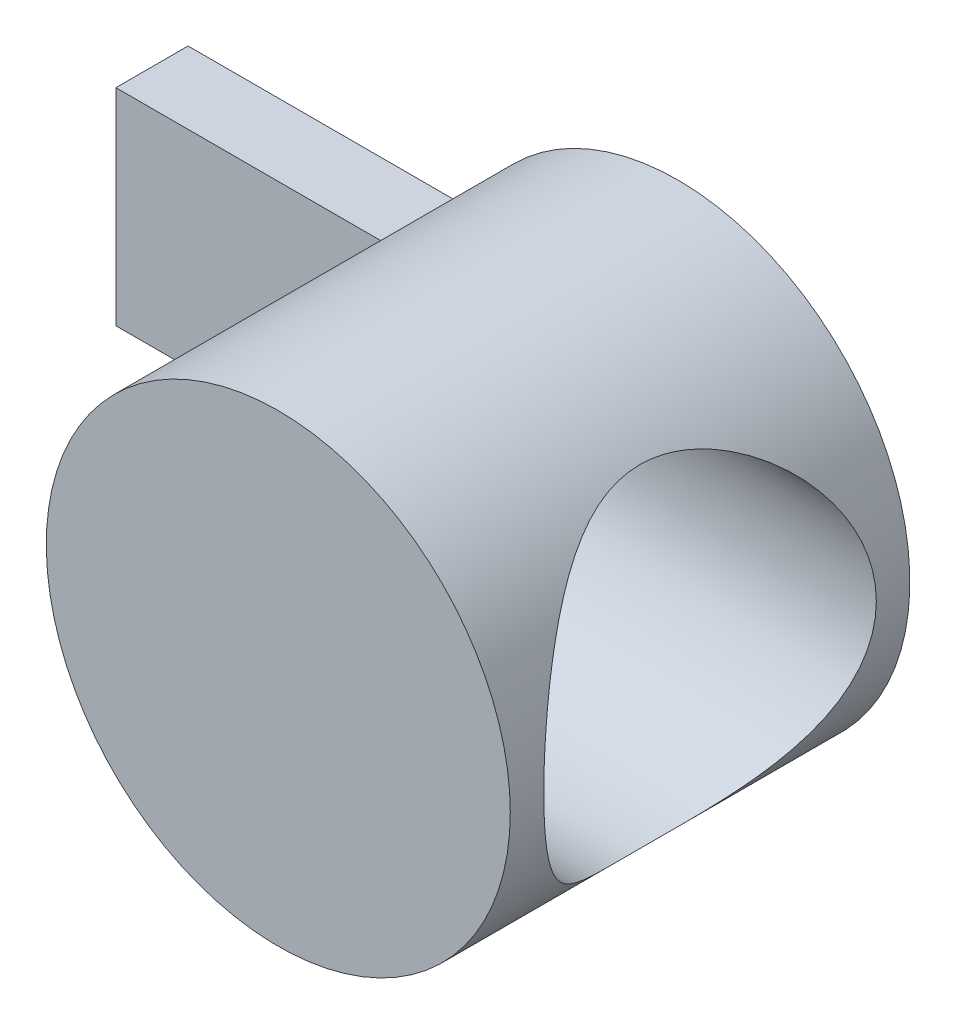
ISO-10303-21;
HEADER;
FILE_DESCRIPTION(('STEP AP214'),'2;1');
FILE_NAME('part.step','',(''),(''),'','','');
FILE_SCHEMA(('AUTOMOTIVE_DESIGN { 1 0 10303 214 1 1 1 1 }'));
ENDSEC;
DATA;
#1=APPLICATION_CONTEXT('core data for automotive mechanical design processes');
#2=APPLICATION_PROTOCOL_DEFINITION('international standard','automotive_design',2000,#1);
#3=PRODUCT_CONTEXT('',#1,'mechanical');
#4=PRODUCT('Part','Part','',(#3));
#5=PRODUCT_RELATED_PRODUCT_CATEGORY('part','',(#4));
#6=PRODUCT_DEFINITION_FORMATION('','',#4);
#7=PRODUCT_DEFINITION_CONTEXT('part definition',#1,'design');
#8=PRODUCT_DEFINITION('design','',#6,#7);
#9=PRODUCT_DEFINITION_SHAPE('','',#8);
#10=(LENGTH_UNIT() NAMED_UNIT(*) SI_UNIT(.MILLI.,.METRE.));
#11=(NAMED_UNIT(*) PLANE_ANGLE_UNIT() SI_UNIT($,.RADIAN.));
#12=(NAMED_UNIT(*) SI_UNIT($,.STERADIAN.) SOLID_ANGLE_UNIT());
#13=UNCERTAINTY_MEASURE_WITH_UNIT(LENGTH_MEASURE(1.E-05),#10,'distance_accuracy_value','');
#14=(GEOMETRIC_REPRESENTATION_CONTEXT(3) GLOBAL_UNCERTAINTY_ASSIGNED_CONTEXT((#13)) GLOBAL_UNIT_ASSIGNED_CONTEXT((#10,
#11,#12)) REPRESENTATION_CONTEXT('',''));
#15=CARTESIAN_POINT('',(0.,0.,0.));
#16=DIRECTION('',(0.,0.,1.));
#17=DIRECTION('',(1.,0.,0.));
#18=AXIS2_PLACEMENT_3D('',#15,#16,#17);
#19=CARTESIAN_POINT('',(0.,0.,15.5));
#20=DIRECTION('',(0.,0.,-1.));
#21=DIRECTION('',(-1.,0.,0.));
#22=AXIS2_PLACEMENT_3D('',#19,#20,#21);
#23=CYLINDRICAL_SURFACE('',#22,9.);
#24=CARTESIAN_POINT('',(-9.,0.,11.75));
#25=CARTESIAN_POINT('',(-8.99999931236003,-0.106543560764115,11.7499991633007));
#26=CARTESIAN_POINT('',(-8.99810295733528,-0.213114535933689,11.745737372374));
#27=CARTESIAN_POINT('',(-8.99056534028924,-0.42548775947288,11.7287335893494));
#28=CARTESIAN_POINT('',(-8.9849219391011,-0.531289533809613,11.7159867531779));
#29=CARTESIAN_POINT('',(-8.97002203225641,-0.741497571680321,11.6821151074332));
#30=CARTESIAN_POINT('',(-8.96075877099567,-0.845900846236376,11.6609746319474));
#31=CARTESIAN_POINT('',(-8.93886560682324,-1.0523739381887,11.6105472820358));
#32=CARTESIAN_POINT('',(-8.92623432770846,-1.15444278316294,11.5812570773423));
#33=CARTESIAN_POINT('',(-8.88385509084484,-1.45528706477071,11.481826836376));
#34=CARTESIAN_POINT('',(-8.84954694128079,-1.64969223818529,11.3999645338792));
#35=CARTESIAN_POINT('',(-8.77205693690159,-2.02169397175996,11.207842670196));
#36=CARTESIAN_POINT('',(-8.72887710525828,-2.19929435076136,11.0975895820297));
#37=CARTESIAN_POINT('',(-8.63520005099137,-2.54295194306068,10.845329590415));
#38=CARTESIAN_POINT('',(-8.58444255570291,-2.70796463469603,10.701994251306));
#39=CARTESIAN_POINT('',(-8.48237167141423,-3.01251193717389,10.3905139421417));
#40=CARTESIAN_POINT('',(-8.43105797021839,-3.15203136079603,10.2223542905208));
#41=CARTESIAN_POINT('',(-8.33031613694453,-3.40970641309573,9.85407902268029));
#42=CARTESIAN_POINT('',(-8.28116793674049,-3.52616342827005,9.65267892352655));
#43=CARTESIAN_POINT('',(-8.21620901778825,-3.67379855799914,9.33644164882016));
#44=CARTESIAN_POINT('',(-8.19601074422211,-3.71851343023117,9.22863042209207));
#45=CARTESIAN_POINT('',(-8.15924882688405,-3.79849956446532,9.00898088433418));
#46=CARTESIAN_POINT('',(-8.14268322901324,-3.83377590592702,8.89714477625805));
#47=CARTESIAN_POINT('',(-8.11458487568386,-3.89288163397949,8.6762099952243));
#48=CARTESIAN_POINT('',(-8.1028347628908,-3.91721191584564,8.56727257329993));
#49=CARTESIAN_POINT('',(-8.08362129694743,-3.95670961203999,8.34742166203978));
#50=CARTESIAN_POINT('',(-8.07615587883755,-3.9718814403629,8.23650915119343));
#51=CARTESIAN_POINT('',(-8.06579894008708,-3.99287182782271,8.01362775517661));
#52=CARTESIAN_POINT('',(-8.06290582244073,-3.99869365272533,7.90165925259327));
#53=CARTESIAN_POINT('',(-8.06180452405908,-4.00091360303008,7.67761087871269));
#54=CARTESIAN_POINT('',(-8.06359604232092,-3.99731233389618,7.5655310150333));
#55=CARTESIAN_POINT('',(-8.07142338434779,-3.98148137626882,7.35227281952782));
#56=CARTESIAN_POINT('',(-8.07706352800997,-3.97005575276389,7.25101953786572));
#57=CARTESIAN_POINT('',(-8.09197245318637,-3.9395760613895,7.04992893082565));
#58=CARTESIAN_POINT('',(-8.10124240729389,-3.92051952834525,6.9500920738277));
#59=CARTESIAN_POINT('',(-8.13408651281412,-3.85217674750056,6.65376237070128));
#60=CARTESIAN_POINT('',(-8.16270181226473,-3.79170447177769,6.46028212196665));
#61=CARTESIAN_POINT('',(-8.23081734439647,-3.64150006667489,6.08210151031394));
#62=CARTESIAN_POINT('',(-8.2705474900895,-3.5511416190136,5.89769571294764));
#63=CARTESIAN_POINT('',(-8.35638151227701,-3.34416344596326,5.54585657136231));
#64=CARTESIAN_POINT('',(-8.40248806916055,-3.22753266369898,5.3784304162798));
#65=CARTESIAN_POINT('',(-8.50133279495595,-2.95801583387873,5.04817022057705));
#66=CARTESIAN_POINT('',(-8.55427944513663,-2.80270476501177,4.88737235198051));
#67=CARTESIAN_POINT('',(-8.65709798777378,-2.46687651443058,4.59336580427856));
#68=CARTESIAN_POINT('',(-8.70696894746715,-2.28635173983005,4.46016546604656));
#69=CARTESIAN_POINT('',(-8.79984898075653,-1.89830549192186,4.22157335103708));
#70=CARTESIAN_POINT('',(-8.84261183911195,-1.69014406889665,4.11711926094858));
#71=CARTESIAN_POINT('',(-8.91451161297059,-1.25681485203023,3.94544615280709));
#72=CARTESIAN_POINT('',(-8.94365711683337,-1.03165788152718,3.87820366073887));
#73=CARTESIAN_POINT('',(-8.98336516942802,-0.587641070885757,3.78737621864508));
#74=CARTESIAN_POINT('',(-8.99508492412832,-0.369442331131814,3.76106658932887));
#75=CARTESIAN_POINT('',(-9.00240007523686,0.0685540826286679,3.74459377002601));
#76=CARTESIAN_POINT('',(-8.9980009485081,0.288351188214384,3.75441830240177));
#77=CARTESIAN_POINT('',(-8.97430591809511,0.70981481436903,3.80808709951779));
#78=CARTESIAN_POINT('',(-8.95589038121198,0.911792765731198,3.84992162133064));
#79=CARTESIAN_POINT('',(-8.90701082021956,1.30558421565956,3.96351612193435));
#80=CARTESIAN_POINT('',(-8.87654533185795,1.49739647572632,4.03527973762285));
#81=CARTESIAN_POINT('',(-8.80524764691282,1.87220783588442,4.20897713672047));
#82=CARTESIAN_POINT('',(-8.76412168349642,2.05474529218522,4.31178231674019));
#83=CARTESIAN_POINT('',(-8.67576208193101,2.40063957243038,4.54370523056152));
#84=CARTESIAN_POINT('',(-8.62852578709614,2.56398799395825,4.67283442382054));
#85=CARTESIAN_POINT('',(-8.52825739375591,2.88073032703291,4.9658239557748));
#86=CARTESIAN_POINT('',(-8.4750650088176,3.03226090719451,5.13164468899731));
#87=CARTESIAN_POINT('',(-8.37207677010347,3.30602071854252,5.48714787975392));
#88=CARTESIAN_POINT('',(-8.32228212493563,3.42823956174355,5.67683876058612));
#89=CARTESIAN_POINT('',(-8.25404075216361,3.58807434164479,5.97824544512302));
#90=CARTESIAN_POINT('',(-8.23214803707208,3.63788387634673,6.08287973293246));
#91=CARTESIAN_POINT('',(-8.19154569522209,3.72840991291049,6.29658892964067));
#92=CARTESIAN_POINT('',(-8.17283464006355,3.76913049781947,6.40566181843561));
#93=CARTESIAN_POINT('',(-8.13929816800195,3.84101557494808,6.62742173572184));
#94=CARTESIAN_POINT('',(-8.1244705014215,3.87218560166711,6.74010662909178));
#95=CARTESIAN_POINT('',(-8.09927719768152,3.92460929100956,6.96824904155855));
#96=CARTESIAN_POINT('',(-8.08891105640648,3.94586407399639,7.08370624584986));
#97=CARTESIAN_POINT('',(-8.07374935283999,3.9767877017106,7.3064793533286));
#98=CARTESIAN_POINT('',(-8.06855529639578,3.98728755575061,7.41365341952659));
#99=CARTESIAN_POINT('',(-8.06245450280349,3.99960939260381,7.62865985613971));
#100=CARTESIAN_POINT('',(-8.06154919368018,4.00142848498409,7.73649243385446));
#101=CARTESIAN_POINT('',(-8.06406616285806,3.99635429337704,7.95184407346926));
#102=CARTESIAN_POINT('',(-8.06748593496455,3.98946605490684,8.05936328078104));
#103=CARTESIAN_POINT('',(-8.07851431964463,3.96708318300727,8.27329765845514));
#104=CARTESIAN_POINT('',(-8.08612450923878,3.95158530941064,8.37971239779129));
#105=CARTESIAN_POINT('',(-8.11370655018847,3.89481025673449,8.68325334764834));
#106=CARTESIAN_POINT('',(-8.13866591875024,3.84284512159463,8.87804393922638));
#107=CARTESIAN_POINT('',(-8.19957700487955,3.71108221021498,9.25599894709622));
#108=CARTESIAN_POINT('',(-8.23553189998355,3.63127638750922,9.43915998412573));
#109=CARTESIAN_POINT('',(-8.31722161393654,3.44024324515819,9.80166470986502));
#110=CARTESIAN_POINT('',(-8.36343549057003,3.32733013865014,9.98001167891759));
#111=CARTESIAN_POINT('',(-8.45929191031224,3.07546946565529,10.3162532488445));
#112=CARTESIAN_POINT('',(-8.50893588001619,2.93651102511198,10.4741392604289));
#113=CARTESIAN_POINT('',(-8.61126362572535,2.622172207908,10.7792405024539));
#114=CARTESIAN_POINT('',(-8.66383343564896,2.44466910724623,10.9243141573913));
#115=CARTESIAN_POINT('',(-8.76186799200869,2.06586629934031,11.1828842090144));
#116=CARTESIAN_POINT('',(-8.80732948852387,1.86455578078997,11.296366180379));
#117=CARTESIAN_POINT('',(-8.86614466582397,1.55009155680925,11.4392195454876));
#118=CARTESIAN_POINT('',(-8.88411858212818,1.4437611556819,11.482125172321));
#119=CARTESIAN_POINT('',(-8.91658812616539,1.22735110682472,11.5587739322013));
#120=CARTESIAN_POINT('',(-8.93108542793378,1.11727329280022,11.5925214760194));
#121=CARTESIAN_POINT('',(-8.95614098674219,0.894475004716058,11.6504023143905));
#122=CARTESIAN_POINT('',(-8.96670865291079,0.781761539000781,11.6745585838433));
#123=CARTESIAN_POINT('',(-8.9836293170273,0.554414643007748,11.7130667387991));
#124=CARTESIAN_POINT('',(-8.98998524296699,0.439782603478103,11.7274254357579));
#125=CARTESIAN_POINT('',(-8.99608997508148,0.270722867755125,11.74119614917));
#126=CARTESIAN_POINT('',(-8.99755504734627,0.216644660495979,11.744496278881));
#127=CARTESIAN_POINT('',(-8.99951024035253,0.108380000601334,11.7488984298566));
#128=CARTESIAN_POINT('',(-9.00000034976913,0.0541935467157945,11.7500004255884));
#129=CARTESIAN_POINT('',(-9.,0.,11.75));
#130=B_SPLINE_CURVE_WITH_KNOTS('',3,(#24,#25,#26,#27,#28,#29,#30,#31,#32,#33,#34,#35,#36,#37,
#38,#39,#40,#41,#42,#43,#44,#45,#46,#47,#48,#49,#50,#51,#52,#53,#54,#55,#56,#57,#58,#59,#60,#61,
#62,#63,#64,#65,#66,#67,#68,#69,#70,#71,#72,#73,#74,#75,#76,#77,#78,#79,#80,#81,#82,#83,#84,#85,
#86,#87,#88,#89,#90,#91,#92,#93,#94,#95,#96,#97,#98,#99,#100,#101,#102,#103,#104,#105,#106,#107,
#108,#109,#110,#111,#112,#113,#114,#115,#116,#117,#118,#119,#120,#121,#122,#123,#124,#125,#126,
#127,#128,#129),.UNSPECIFIED.,.T.,.F.,(4,2,2,2,2,2,2,2,2,2,2,2,2,2,2,2,2,2,2,2,2,2,2,2,2,2,2,2,
2,2,2,2,2,2,2,2,2,2,2,2,2,2,2,2,2,2,2,2,2,2,2,2,4),(0.,0.319575995494491,0.639334592113709,
0.959692813851972,1.28018213803926,1.91817504615677,2.55602262225846,3.22626867716013,
3.89691272815776,4.6062783907758,4.96122462740457,5.31597945944821,5.65223953951962,
5.9883374265179,6.32431789582033,6.66027677783181,6.96605959233536,7.27194127015288,
7.88320420131182,8.50818797600341,9.13343527205269,9.81959120458711,10.5059542142737,
11.2125921876432,11.9187838863229,12.5755805291255,13.2321540266912,13.8505799936734,
14.4690811319117,15.1068781804635,15.7449534721389,16.4344546029635,17.1241997308767,
17.4776093864017,17.8308599580232,18.1839054338953,18.5369110080658,18.8599212751303,
19.183039087411,19.5059697528593,19.8290220330897,20.4355356034002,21.042224612609,
21.6877902452578,22.3336260075754,23.0359566714551,23.7386075078666,24.0863996614848,
24.4340240108549,24.7808105646473,25.1273557796159,25.2899067151077,25.4524595387309),.UNSPECIFIED.);
#131=CARTESIAN_POINT('',(-9.,0.,11.75));
#132=VERTEX_POINT('',#131);
#133=EDGE_CURVE('E39',#132,#132,#130,.T.);
#134=ORIENTED_EDGE('',*,*,#133,.T.);
#135=EDGE_LOOP('',(#134));
#136=FACE_BOUND('',#135,.T.);
#137=CARTESIAN_POINT('',(9.,0.,1.3));
#138=CARTESIAN_POINT('',(9.0000004850014,-0.159498639597367,1.29999948331928));
#139=CARTESIAN_POINT('',(8.99575150055317,-0.318991086225657,1.3059242146766));
#140=CARTESIAN_POINT('',(8.97886269675915,-0.636647160183717,1.32952155510641));
#141=CARTESIAN_POINT('',(8.96622330865316,-0.79481085538399,1.3471935604068));
#142=CARTESIAN_POINT('',(8.93285467739944,-1.1086090332813,1.39400583995996));
#143=CARTESIAN_POINT('',(8.91212286065154,-1.26424269494475,1.42314976260201));
#144=CARTESIAN_POINT('',(8.86305223747962,-1.57180212684456,1.49246110764148));
#145=CARTESIAN_POINT('',(8.83471322901195,-1.7237277984814,1.53262882282658));
#146=CARTESIAN_POINT('',(8.77121441550993,-2.02211155862988,1.62319488885689));
#147=CARTESIAN_POINT('',(8.73609157999136,-2.16859437033214,1.673537854228));
#148=CARTESIAN_POINT('',(8.6596377972059,-2.45618664766972,1.78397898996446));
#149=CARTESIAN_POINT('',(8.61830440988852,-2.59729397390531,1.8440809952902));
#150=CARTESIAN_POINT('',(8.48615962476383,-3.01145763135438,2.03804514696006));
#151=CARTESIAN_POINT('',(8.38714621697473,-3.27561560439984,2.1856457284675));
#152=CARTESIAN_POINT('',(8.16434708103197,-3.79889499482997,2.52722952706931));
#153=CARTESIAN_POINT('',(8.03913493238147,-4.05543158784186,2.72418854152079));
#154=CARTESIAN_POINT('',(7.77913405978902,-4.53423464288564,3.15148632496046));
#155=CARTESIAN_POINT('',(7.64433113497437,-4.7564486740179,3.38187514003668));
#156=CARTESIAN_POINT('',(7.42975997042089,-5.08131360679976,3.77274798397664));
#157=CARTESIAN_POINT('',(7.34992085004186,-5.19581911348942,3.92352331229438));
#158=CARTESIAN_POINT('',(7.19246321283651,-5.41168133482241,4.23543219502118));
#159=CARTESIAN_POINT('',(7.11484531073831,-5.51303443641534,4.39656857757494));
#160=CARTESIAN_POINT('',(6.96447210103181,-5.7018138114046,4.72870171219164));
#161=CARTESIAN_POINT('',(6.89171102518012,-5.78925678244132,4.89968630135635));
#162=CARTESIAN_POINT('',(6.75389986068445,-5.94945283842893,5.2512300019336));
#163=CARTESIAN_POINT('',(6.68884557672682,-6.02221393100498,5.43178382597836));
#164=CARTESIAN_POINT('',(6.54859456089805,-6.17496536319833,5.86779658448657));
#165=CARTESIAN_POINT('',(6.47794454550304,-6.24841547015462,6.12716802848868));
#166=CARTESIAN_POINT('',(6.39371400021936,-6.33419356708283,6.52566803002862));
#167=CARTESIAN_POINT('',(6.36926784585579,-6.35871408223204,6.66000751651607));
#168=CARTESIAN_POINT('',(6.32851374950698,-6.39927723960209,6.93115580534092));
#169=CARTESIAN_POINT('',(6.31220182972792,-6.41532402586261,7.06796336676026));
#170=CARTESIAN_POINT('',(6.28834174008093,-6.43871432008173,7.34405722743562));
#171=CARTESIAN_POINT('',(6.28085571142238,-6.44599612309289,7.483354174015));
#172=CARTESIAN_POINT('',(6.27520592506972,-6.45149650929664,7.76231573009866));
#173=CARTESIAN_POINT('',(6.27704187039453,-6.44971538121764,7.90198032774855));
#174=CARTESIAN_POINT('',(6.28995292168004,-6.43712449104615,8.18056419295547));
#175=CARTESIAN_POINT('',(6.30103447941969,-6.42630842418075,8.31948287184625));
#176=CARTESIAN_POINT('',(6.33193022232115,-6.39586778938326,8.59536593638841));
#177=CARTESIAN_POINT('',(6.35174539579443,-6.37624222454809,8.73233009905184));
#178=CARTESIAN_POINT('',(6.40224783553958,-6.325555844547,9.02036223504423));
#179=CARTESIAN_POINT('',(6.43398623159797,-6.29337036357371,9.17104721484636));
#180=CARTESIAN_POINT('',(6.5059867152721,-6.21890761200338,9.46788570744279));
#181=CARTESIAN_POINT('',(6.54625453107866,-6.17662355695658,9.61403609889284));
#182=CARTESIAN_POINT('',(6.63378357206778,-6.08251978973284,9.90135983272829));
#183=CARTESIAN_POINT('',(6.68105705928664,-6.03068331841032,10.0425238999568));
#184=CARTESIAN_POINT('',(6.78097747808909,-5.91810850831272,10.3192015016798));
#185=CARTESIAN_POINT('',(6.83362286408476,-5.85737272784207,10.4547166457502));
#186=CARTESIAN_POINT('',(6.96009514079807,-5.70697124362708,10.7617609311791));
#187=CARTESIAN_POINT('',(7.03537024306364,-5.61421929633088,10.9311870689404));
#188=CARTESIAN_POINT('',(7.18992459532902,-5.41487798193182,11.2597779761926));
#189=CARTESIAN_POINT('',(7.26920499461637,-5.30828462921355,11.4189397702452));
#190=CARTESIAN_POINT('',(7.42935595744759,-5.08172528195237,11.7268233743455));
#191=CARTESIAN_POINT('',(7.51022779629981,-4.96174817025012,11.8755363354877));
#192=CARTESIAN_POINT('',(7.67128982572993,-4.70890448062629,12.1619385433799));
#193=CARTESIAN_POINT('',(7.75148008604454,-4.57603923906828,12.2996289303584));
#194=CARTESIAN_POINT('',(7.90999378280044,-4.29629072802354,12.5647591894596));
#195=CARTESIAN_POINT('',(7.98828904638812,-4.1492757729104,12.6920772501963));
#196=CARTESIAN_POINT('',(8.14016164816654,-3.84278767739645,12.9339743892621));
#197=CARTESIAN_POINT('',(8.21373851230163,-3.68331328876088,13.0485521884284));
#198=CARTESIAN_POINT('',(8.35409740655891,-3.35279452170545,13.2636255319405));
#199=CARTESIAN_POINT('',(8.4208923339485,-3.18177317466469,13.3641479483009));
#200=CARTESIAN_POINT('',(8.54594820875911,-2.82874444239897,13.5500396268687));
#201=CARTESIAN_POINT('',(8.60421236791262,-2.64674122834757,13.6354145944868));
#202=CARTESIAN_POINT('',(8.69681853578112,-2.32083229524553,13.769873315031));
#203=CARTESIAN_POINT('',(8.73346691896748,-2.17909481285923,13.8226533688306));
#204=CARTESIAN_POINT('',(8.80036051975315,-1.89090461658384,13.9184701355587));
#205=CARTESIAN_POINT('',(8.83060711876907,-1.7444529278296,13.9615089506512));
#206=CARTESIAN_POINT('',(8.88407517940519,-1.4477298820665,14.0372897484512));
#207=CARTESIAN_POINT('',(8.90730032162954,-1.2974605711718,14.0700371262232));
#208=CARTESIAN_POINT('',(8.94624743827541,-0.994008910334233,14.1248109475116));
#209=CARTESIAN_POINT('',(8.96196920437046,-0.840826479633215,14.1468370933601));
#210=CARTESIAN_POINT('',(8.98559061401805,-0.53216179840362,14.1798890453979));
#211=CARTESIAN_POINT('',(8.99346430601133,-0.376673631938929,14.1908783565227));
#212=CARTESIAN_POINT('',(9.0011134238989,-0.0651094847861302,14.2015546054042));
#213=CARTESIAN_POINT('',(9.00088886668796,0.0909664946749894,14.2012415667401));
#214=CARTESIAN_POINT('',(8.99234640545314,0.402474934391334,14.1893175971362));
#215=CARTESIAN_POINT('',(8.98402781430844,0.557907338887005,14.1777057070114));
#216=CARTESIAN_POINT('',(8.95949254965731,0.866900349132155,14.1433676900199));
#217=CARTESIAN_POINT('',(8.94327603196285,1.02046099174689,14.1206417824129));
#218=CARTESIAN_POINT('',(8.90430170851231,1.31706479302763,14.0658089470793));
#219=CARTESIAN_POINT('',(8.88190736452774,1.46025234342349,14.0342219690488));
#220=CARTESIAN_POINT('',(8.8307580112025,1.74310297755189,13.9617179598845));
#221=CARTESIAN_POINT('',(8.8020008301306,1.88276483973818,13.9207977430295));
#222=CARTESIAN_POINT('',(8.70696613587574,2.29524371256658,13.784735111872));
#223=CARTESIAN_POINT('',(8.6318950476338,2.56177659177306,13.6762486943282));
#224=CARTESIAN_POINT('',(8.45577789111183,3.09614257444722,13.4167937681545));
#225=CARTESIAN_POINT('',(8.35300733467644,3.36195310442345,13.2628901552013));
#226=CARTESIAN_POINT('',(8.13240258192247,3.86516664404727,12.9225550954247));
#227=CARTESIAN_POINT('',(8.01455702122753,4.10254795804771,12.7360990696971));
#228=CARTESIAN_POINT('',(7.82093809539603,4.45594047679437,12.4167363272885));
#229=CARTESIAN_POINT('',(7.74765991974379,4.58189688361948,12.2930991706694));
#230=CARTESIAN_POINT('',(7.59993379275996,4.82296182062199,12.0363194262084));
#231=CARTESIAN_POINT('',(7.52548605512229,4.93807230620017,11.9031785594182));
#232=CARTESIAN_POINT('',(7.3770191971695,5.15724033022837,11.627678356642));
#233=CARTESIAN_POINT('',(7.3030004579736,5.261289146352,11.4853118863908));
#234=CARTESIAN_POINT('',(7.15728336913666,5.4578615497286,11.1917215089288));
#235=CARTESIAN_POINT('',(7.08558462888367,5.55038708467766,11.0404991049419));
#236=CARTESIAN_POINT('',(6.95697209293979,5.71046872873523,10.7526587008031));
#237=CARTESIAN_POINT('',(6.89945045422344,5.77968978949074,10.6172372993538));
#238=CARTESIAN_POINT('',(6.78900444112328,5.90903138020187,10.3402160827254));
#239=CARTESIAN_POINT('',(6.7360816389211,5.96914880311706,10.1986141793082));
#240=CARTESIAN_POINT('',(6.63655009493202,6.07961547024513,9.909778117036));
#241=CARTESIAN_POINT('',(6.58993089876969,6.12998094927912,9.76255381616858));
#242=CARTESIAN_POINT('',(6.5046579084525,6.2203932947018,9.4627993305667));
#243=CARTESIAN_POINT('',(6.46599845709009,6.2604474947011,9.31027300487202));
#244=CARTESIAN_POINT('',(6.40480790528115,6.32297131548965,9.03023530095707));
#245=CARTESIAN_POINT('',(6.38060658377537,6.34733844329574,8.90351139546606));
#246=CARTESIAN_POINT('',(6.33936309785047,6.38853103251773,8.64773912696364));
#247=CARTESIAN_POINT('',(6.32231740929323,6.40536020663833,8.5186919409007));
#248=CARTESIAN_POINT('',(6.29603498485078,6.43119629627478,8.2591254022487));
#249=CARTESIAN_POINT('',(6.28679191636656,6.44020955534204,8.12860733078691));
#250=CARTESIAN_POINT('',(6.27647055917164,6.45026894557059,7.86693683226733));
#251=CARTESIAN_POINT('',(6.27539238032898,6.45131496952352,7.73578439669719));
#252=CARTESIAN_POINT('',(6.28145175424796,6.4454158325793,7.47381137412074));
#253=CARTESIAN_POINT('',(6.28859160612113,6.43846843540859,7.34299089024641));
#254=CARTESIAN_POINT('',(6.31077829776308,6.4167203237578,7.0827084227448));
#255=CARTESIAN_POINT('',(6.325825111377,6.40191963525504,6.9532464346253));
#256=CARTESIAN_POINT('',(6.38204586086421,6.34605403537027,6.56788356575087));
#257=CARTESIAN_POINT('',(6.43429495006352,6.29352993053745,6.31517734896214));
#258=CARTESIAN_POINT('',(6.58265981229641,6.13867337019453,5.74133127512301));
#259=CARTESIAN_POINT('',(6.68758951024702,6.02557880394186,5.42542721088209));
#260=CARTESIAN_POINT('',(6.8621815942534,5.82395473846976,4.97305063758809));
#261=CARTESIAN_POINT('',(6.92332927910495,5.75130948185824,4.82567383566886));
#262=CARTESIAN_POINT('',(7.04960112620624,5.59581420194074,4.53813971756352));
#263=CARTESIAN_POINT('',(7.11472499363292,5.512964934772,4.39798186752913));
#264=CARTESIAN_POINT('',(7.24909299057952,5.33511054766508,4.12138219147762));
#265=CARTESIAN_POINT('',(7.31840100634985,5.23983613186436,3.98514506434632));
#266=CARTESIAN_POINT('',(7.45790141773453,5.03931201873066,3.72068318293553));
#267=CARTESIAN_POINT('',(7.52809412261467,4.93405874417116,3.59246132951627));
#268=CARTESIAN_POINT('',(7.73786232757844,4.60362251745654,3.22018569983561));
#269=CARTESIAN_POINT('',(7.87669463942409,4.36367806071783,2.98838971115772));
#270=CARTESIAN_POINT('',(8.08725857876653,3.9529406134214,2.64942688919382));
#271=CARTESIAN_POINT('',(8.16317982821261,3.79408634455609,2.53010453640976));
#272=CARTESIAN_POINT('',(8.30865570639667,3.46391848481288,2.30540457617733));
#273=CARTESIAN_POINT('',(8.37820928302334,3.29260284334141,2.20002927188019));
#274=CARTESIAN_POINT('',(8.50883393084398,2.93859058229282,2.00474038356128));
#275=CARTESIAN_POINT('',(8.56991502366909,2.75590778545684,1.91480850186417));
#276=CARTESIAN_POINT('',(8.68176662048892,2.38018805502252,1.75174231592965));
#277=CARTESIAN_POINT('',(8.73254085975378,2.18715490463509,1.67860192508472));
#278=CARTESIAN_POINT('',(8.81312112498914,1.83171976666346,1.56332557961476));
#279=CARTESIAN_POINT('',(8.84508904610134,1.6708623371404,1.5179163454998));
#280=CARTESIAN_POINT('',(8.90050805306507,1.34472775496337,1.43950750746186));
#281=CARTESIAN_POINT('',(8.92396107472058,1.17945161605757,1.40650508287531));
#282=CARTESIAN_POINT('',(8.96172550759472,0.845941071438976,1.35348767617918));
#283=CARTESIAN_POINT('',(8.97604482152374,0.677709352841494,1.33346146648843));
#284=CARTESIAN_POINT('',(8.99518165874101,0.339649382096126,1.30671811466928));
#285=CARTESIAN_POINT('',(8.99999948360995,0.1698211807931,1.30000055011961));
#286=CARTESIAN_POINT('',(9.,0.,1.3));
#287=B_SPLINE_CURVE_WITH_KNOTS('',3,(#137,#138,#139,#140,#141,#142,#143,#144,#145,#146,#147,
#148,#149,#150,#151,#152,#153,#154,#155,#156,#157,#158,#159,#160,#161,#162,#163,#164,#165,#166,
#167,#168,#169,#170,#171,#172,#173,#174,#175,#176,#177,#178,#179,#180,#181,#182,#183,#184,#185,
#186,#187,#188,#189,#190,#191,#192,#193,#194,#195,#196,#197,#198,#199,#200,#201,#202,#203,#204,
#205,#206,#207,#208,#209,#210,#211,#212,#213,#214,#215,#216,#217,#218,#219,#220,#221,#222,#223,
#224,#225,#226,#227,#228,#229,#230,#231,#232,#233,#234,#235,#236,#237,#238,#239,#240,#241,#242,
#243,#244,#245,#246,#247,#248,#249,#250,#251,#252,#253,#254,#255,#256,#257,#258,#259,#260,#261,
#262,#263,#264,#265,#266,#267,#268,#269,#270,#271,#272,#273,#274,#275,#276,#277,#278,#279,#280,
#281,#282,#283,#284,#285,#286),.UNSPECIFIED.,.T.,.F.,(4,2,2,2,2,2,2,2,2,2,2,2,2,2,2,2,2,2,2,2,2,
2,2,2,2,2,2,2,2,2,2,2,2,2,2,2,2,2,2,2,2,2,2,2,2,2,2,2,2,2,2,2,2,2,2,2,2,2,2,2,2,2,2,2,2,2,2,2,2,
2,2,2,2,2,4),(0.,0.478320229053199,0.956615875885757,1.43506375711409,1.91352434696422,
2.38944753349782,2.86555819578624,3.81695449525979,4.85382897911056,5.8922720450562,
6.50810169827926,7.1241001673593,7.73935352280081,8.35427040121549,9.18660742256384,
9.60237156350981,10.0179321880927,10.4364015372154,10.8548575547528,11.2736058239973,
11.6924014917108,12.1636691769465,12.635254365501,13.1076749383425,13.5799599688597,
14.2010236107753,14.8222664854122,15.44402929015,16.0657276933976,16.6939066150638,
17.3221485510497,17.9491724501585,18.5759596718592,19.0423641157597,19.5086678131822,
19.9747266515735,20.4407984290397,20.9084063231105,21.3760132416464,21.8436598598542,
22.3112972526034,22.7557904122746,23.2004355187665,24.0890476479087,25.0572661302725,
26.0262188590346,26.5990591671424,27.1717960000068,27.7449811479351,28.3180692826983,
28.805478896496,29.2930544884095,29.7798112613663,30.2662208796451,30.6597114174567,
31.0530079337835,31.4459849433033,31.8389672407742,32.2320595073867,32.6251504737265,
33.4118408175362,34.4605136601422,34.9861179100661,35.511683235089,36.0515406300195,
36.5915922903859,37.6711876501032,38.3085200670961,38.9459575992601,39.5826345922441,
40.2190804358206,40.728930702228,41.2386649849866,41.7479576326126,42.2572341148453),.UNSPECIFIED.);
#288=CARTESIAN_POINT('',(9.,0.,1.3));
#289=VERTEX_POINT('',#288);
#290=EDGE_CURVE('E11',#289,#289,#287,.T.);
#291=ORIENTED_EDGE('',*,*,#290,.T.);
#292=EDGE_LOOP('',(#291));
#293=FACE_BOUND('',#292,.T.);
#294=CARTESIAN_POINT('',(0.,0.,15.5));
#295=DIRECTION('',(0.,0.,1.));
#296=DIRECTION('',(1.,0.,0.));
#297=AXIS2_PLACEMENT_3D('',#294,#295,#296);
#298=CIRCLE('',#297,9.);
#299=CARTESIAN_POINT('',(9.,0.,15.5));
#300=VERTEX_POINT('',#299);
#301=EDGE_CURVE('E115',#300,#300,#298,.T.);
#302=ORIENTED_EDGE('',*,*,#301,.F.);
#303=EDGE_LOOP('',(#302));
#304=FACE_BOUND('',#303,.T.);
#305=DIRECTION('',(0.,0.,-1.));
#306=VECTOR('',#305,1.);
#307=CARTESIAN_POINT('',(-8.06225774829855,4.,2.8));
#308=LINE('',#307,#306);
#309=CARTESIAN_POINT('',(-8.06225774829855,4.,2.8));
#310=VERTEX_POINT('',#309);
#311=CARTESIAN_POINT('',(-8.06225774829855,4.,0.));
#312=VERTEX_POINT('',#311);
#313=EDGE_CURVE('E55',#310,#312,#308,.T.);
#314=ORIENTED_EDGE('',*,*,#313,.F.);
#315=CARTESIAN_POINT('',(0.,0.,2.8));
#316=DIRECTION('',(0.,0.,-1.));
#317=DIRECTION('',(-1.,0.,0.));
#318=AXIS2_PLACEMENT_3D('',#315,#316,#317);
#319=CIRCLE('',#318,9.);
#320=CARTESIAN_POINT('',(-8.06225774829855,-4.,2.8));
#321=VERTEX_POINT('',#320);
#322=EDGE_CURVE('E48',#321,#310,#319,.T.);
#323=ORIENTED_EDGE('',*,*,#322,.F.);
#324=DIRECTION('',(0.,0.,-1.));
#325=VECTOR('',#324,1.);
#326=CARTESIAN_POINT('',(-8.06225774829855,-4.,2.8));
#327=LINE('',#326,#325);
#328=CARTESIAN_POINT('',(-8.06225774829855,-4.,0.));
#329=VERTEX_POINT('',#328);
#330=EDGE_CURVE('E101',#321,#329,#327,.T.);
#331=ORIENTED_EDGE('',*,*,#330,.T.);
#332=CARTESIAN_POINT('',(0.,0.,0.));
#333=DIRECTION('',(0.,0.,1.));
#334=DIRECTION('',(1.,0.,0.));
#335=AXIS2_PLACEMENT_3D('',#332,#333,#334);
#336=CIRCLE('',#335,9.);
#337=EDGE_CURVE('E114',#329,#312,#336,.T.);
#338=ORIENTED_EDGE('',*,*,#337,.T.);
#339=EDGE_LOOP('',(#314,#323,#331,#338));
#340=FACE_BOUND('',#339,.T.);
#341=ADVANCED_FACE('F35',(#136,#293,#304,#340),#23,.T.);
#342=CARTESIAN_POINT('',(0.,0.,15.5));
#343=DIRECTION('',(0.,0.,1.));
#344=DIRECTION('',(1.,0.,0.));
#345=AXIS2_PLACEMENT_3D('',#342,#343,#344);
#346=PLANE('',#345);
#347=ORIENTED_EDGE('',*,*,#301,.T.);
#348=EDGE_LOOP('',(#347));
#349=FACE_BOUND('',#348,.T.);
#350=ADVANCED_FACE('F141',(#349),#346,.T.);
#351=CARTESIAN_POINT('',(0.,0.,0.));
#352=DIRECTION('',(0.,0.,1.));
#353=DIRECTION('',(1.,0.,0.));
#354=AXIS2_PLACEMENT_3D('',#351,#352,#353);
#355=PLANE('',#354);
#356=ORIENTED_EDGE('',*,*,#337,.F.);
#357=DIRECTION('',(1.,0.,0.));
#358=VECTOR('',#357,1.);
#359=CARTESIAN_POINT('',(-8.06225774829855,-4.,0.));
#360=LINE('',#359,#358);
#361=CARTESIAN_POINT('',(-19.,-4.,0.));
#362=VERTEX_POINT('',#361);
#363=EDGE_CURVE('E85',#362,#329,#360,.T.);
#364=ORIENTED_EDGE('',*,*,#363,.F.);
#365=DIRECTION('',(0.,-1.,0.));
#366=VECTOR('',#365,1.);
#367=CARTESIAN_POINT('',(-19.,4.,0.));
#368=LINE('',#367,#366);
#369=CARTESIAN_POINT('',(-19.,4.,0.));
#370=VERTEX_POINT('',#369);
#371=EDGE_CURVE('E106',#370,#362,#368,.T.);
#372=ORIENTED_EDGE('',*,*,#371,.F.);
#373=DIRECTION('',(-1.,0.,0.));
#374=VECTOR('',#373,1.);
#375=CARTESIAN_POINT('',(-8.06225774829855,4.,0.));
#376=LINE('',#375,#374);
#377=EDGE_CURVE('E91',#312,#370,#376,.T.);
#378=ORIENTED_EDGE('',*,*,#377,.F.);
#379=EDGE_LOOP('',(#356,#364,#372,#378));
#380=FACE_BOUND('',#379,.T.);
#381=ADVANCED_FACE('F140',(#380),#355,.F.);
#382=CARTESIAN_POINT('',(-8.06225774829855,4.,2.8));
#383=DIRECTION('',(0.,-1.,0.));
#384=DIRECTION('',(1.,0.,0.));
#385=AXIS2_PLACEMENT_3D('',#382,#383,#384);
#386=PLANE('',#385);
#387=ORIENTED_EDGE('',*,*,#377,.T.);
#388=DIRECTION('',(0.,0.,-1.));
#389=VECTOR('',#388,1.);
#390=CARTESIAN_POINT('',(-19.,4.,2.8));
#391=LINE('',#390,#389);
#392=CARTESIAN_POINT('',(-19.,4.,2.8));
#393=VERTEX_POINT('',#392);
#394=EDGE_CURVE('E88',#393,#370,#391,.T.);
#395=ORIENTED_EDGE('',*,*,#394,.F.);
#396=DIRECTION('',(-1.,0.,0.));
#397=VECTOR('',#396,1.);
#398=CARTESIAN_POINT('',(-8.06225774829855,4.,2.8));
#399=LINE('',#398,#397);
#400=EDGE_CURVE('E78',#310,#393,#399,.T.);
#401=ORIENTED_EDGE('',*,*,#400,.F.);
#402=ORIENTED_EDGE('',*,*,#313,.T.);
#403=EDGE_LOOP('',(#387,#395,#401,#402));
#404=FACE_BOUND('',#403,.T.);
#405=ADVANCED_FACE('F89',(#404),#386,.F.);
#406=CARTESIAN_POINT('',(-19.,4.,2.8));
#407=DIRECTION('',(1.,0.,0.));
#408=DIRECTION('',(0.,0.,-1.));
#409=AXIS2_PLACEMENT_3D('',#406,#407,#408);
#410=PLANE('',#409);
#411=ORIENTED_EDGE('',*,*,#371,.T.);
#412=DIRECTION('',(0.,0.,-1.));
#413=VECTOR('',#412,1.);
#414=CARTESIAN_POINT('',(-19.,-4.,2.8));
#415=LINE('',#414,#413);
#416=CARTESIAN_POINT('',(-19.,-4.,2.8));
#417=VERTEX_POINT('',#416);
#418=EDGE_CURVE('E94',#417,#362,#415,.T.);
#419=ORIENTED_EDGE('',*,*,#418,.F.);
#420=DIRECTION('',(0.,-1.,0.));
#421=VECTOR('',#420,1.);
#422=CARTESIAN_POINT('',(-19.,4.,2.8));
#423=LINE('',#422,#421);
#424=EDGE_CURVE('E82',#393,#417,#423,.T.);
#425=ORIENTED_EDGE('',*,*,#424,.F.);
#426=ORIENTED_EDGE('',*,*,#394,.T.);
#427=EDGE_LOOP('',(#411,#419,#425,#426));
#428=FACE_BOUND('',#427,.T.);
#429=ADVANCED_FACE('F96',(#428),#410,.F.);
#430=CARTESIAN_POINT('',(-8.06225774829855,-4.,2.8));
#431=DIRECTION('',(0.,1.,0.));
#432=DIRECTION('',(-1.,0.,0.));
#433=AXIS2_PLACEMENT_3D('',#430,#431,#432);
#434=PLANE('',#433);
#435=ORIENTED_EDGE('',*,*,#363,.T.);
#436=ORIENTED_EDGE('',*,*,#330,.F.);
#437=DIRECTION('',(1.,0.,0.));
#438=VECTOR('',#437,1.);
#439=CARTESIAN_POINT('',(-8.06225774829855,-4.,2.8));
#440=LINE('',#439,#438);
#441=EDGE_CURVE('E99',#417,#321,#440,.T.);
#442=ORIENTED_EDGE('',*,*,#441,.F.);
#443=ORIENTED_EDGE('',*,*,#418,.T.);
#444=EDGE_LOOP('',(#435,#436,#442,#443));
#445=FACE_BOUND('',#444,.T.);
#446=ADVANCED_FACE('F132',(#445),#434,.F.);
#447=CARTESIAN_POINT('',(0.,0.,2.8));
#448=DIRECTION('',(0.,0.,-1.));
#449=DIRECTION('',(-1.,0.,0.));
#450=AXIS2_PLACEMENT_3D('',#447,#448,#449);
#451=PLANE('',#450);
#452=ORIENTED_EDGE('',*,*,#441,.T.);
#453=ORIENTED_EDGE('',*,*,#322,.T.);
#454=ORIENTED_EDGE('',*,*,#400,.T.);
#455=ORIENTED_EDGE('',*,*,#424,.T.);
#456=EDGE_LOOP('',(#452,#453,#454,#455));
#457=FACE_BOUND('',#456,.T.);
#458=ADVANCED_FACE('F80',(#457),#451,.F.);
#459=CARTESIAN_POINT('',(-2.,0.,7.75));
#460=DIRECTION('',(1.,0.,0.));
#461=DIRECTION('',(0.,0.,-1.));
#462=AXIS2_PLACEMENT_3D('',#459,#460,#461);
#463=CYLINDRICAL_SURFACE('',#462,6.45);
#464=CARTESIAN_POINT('',(-2.,0.,7.75));
#465=DIRECTION('',(1.,0.,0.));
#466=DIRECTION('',(0.,0.,-1.));
#467=AXIS2_PLACEMENT_3D('',#464,#465,#466);
#468=CIRCLE('',#467,6.45);
#469=CARTESIAN_POINT('',(-2.,0.,1.3));
#470=VERTEX_POINT('',#469);
#471=EDGE_CURVE('E107',#470,#470,#468,.T.);
#472=ORIENTED_EDGE('',*,*,#471,.F.);
#473=EDGE_LOOP('',(#472));
#474=FACE_BOUND('',#473,.T.);
#475=ORIENTED_EDGE('',*,*,#290,.F.);
#476=EDGE_LOOP('',(#475));
#477=FACE_BOUND('',#476,.T.);
#478=ADVANCED_FACE('F123',(#474,#477),#463,.F.);
#479=CARTESIAN_POINT('',(-2.,0.,7.75));
#480=DIRECTION('',(1.,0.,0.));
#481=DIRECTION('',(0.,0.,-1.));
#482=AXIS2_PLACEMENT_3D('',#479,#480,#481);
#483=PLANE('',#482);
#484=CARTESIAN_POINT('',(-2.,0.,7.75));
#485=DIRECTION('',(1.,0.,0.));
#486=DIRECTION('',(0.,0.,-1.));
#487=AXIS2_PLACEMENT_3D('',#484,#485,#486);
#488=CIRCLE('',#487,4.);
#489=CARTESIAN_POINT('',(-2.,0.,3.75));
#490=VERTEX_POINT('',#489);
#491=EDGE_CURVE('E160',#490,#490,#488,.T.);
#492=ORIENTED_EDGE('',*,*,#491,.F.);
#493=EDGE_LOOP('',(#492));
#494=FACE_BOUND('',#493,.T.);
#495=ORIENTED_EDGE('',*,*,#471,.T.);
#496=EDGE_LOOP('',(#495));
#497=FACE_BOUND('',#496,.T.);
#498=ADVANCED_FACE('F128',(#494,#497),#483,.T.);
#499=CARTESIAN_POINT('',(-19.,0.,7.75));
#500=DIRECTION('',(1.,0.,0.));
#501=DIRECTION('',(0.,0.,-1.));
#502=AXIS2_PLACEMENT_3D('',#499,#500,#501);
#503=CYLINDRICAL_SURFACE('',#502,4.);
#504=ORIENTED_EDGE('',*,*,#491,.T.);
#505=EDGE_LOOP('',(#504));
#506=FACE_BOUND('',#505,.T.);
#507=ORIENTED_EDGE('',*,*,#133,.F.);
#508=EDGE_LOOP('',(#507));
#509=FACE_BOUND('',#508,.T.);
#510=ADVANCED_FACE('F166',(#506,#509),#503,.F.);
#511=CLOSED_SHELL('',(#341,#350,#381,#405,#429,#446,#458,#478,#498,#510));
#512=MANIFOLD_SOLID_BREP('B2',#511);
#513=ADVANCED_BREP_SHAPE_REPRESENTATION('',(#18,#512),#14);
#514=SHAPE_DEFINITION_REPRESENTATION(#9,#513);
ENDSEC;
END-ISO-10303-21;
